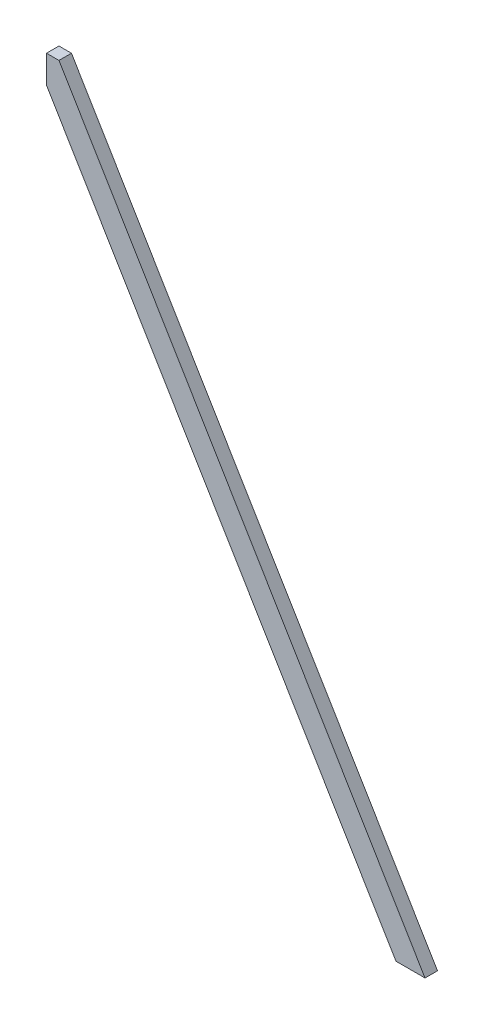
ISO-10303-21;
HEADER;
FILE_DESCRIPTION(('STEP AP214'),'2;1');
FILE_NAME('part.step','',(''),(''),'','','');
FILE_SCHEMA(('AUTOMOTIVE_DESIGN { 1 0 10303 214 1 1 1 1 }'));
ENDSEC;
DATA;
#1=APPLICATION_CONTEXT('core data for automotive mechanical design processes');
#2=APPLICATION_PROTOCOL_DEFINITION('international standard','automotive_design',2000,#1);
#3=PRODUCT_CONTEXT('',#1,'mechanical');
#4=PRODUCT('Part','Part','',(#3));
#5=PRODUCT_RELATED_PRODUCT_CATEGORY('part','',(#4));
#6=PRODUCT_DEFINITION_FORMATION('','',#4);
#7=PRODUCT_DEFINITION_CONTEXT('part definition',#1,'design');
#8=PRODUCT_DEFINITION('design','',#6,#7);
#9=PRODUCT_DEFINITION_SHAPE('','',#8);
#10=(LENGTH_UNIT() NAMED_UNIT(*) SI_UNIT(.MILLI.,.METRE.));
#11=(NAMED_UNIT(*) PLANE_ANGLE_UNIT() SI_UNIT($,.RADIAN.));
#12=(NAMED_UNIT(*) SI_UNIT($,.STERADIAN.) SOLID_ANGLE_UNIT());
#13=UNCERTAINTY_MEASURE_WITH_UNIT(LENGTH_MEASURE(1.E-05),#10,'distance_accuracy_value','');
#14=(GEOMETRIC_REPRESENTATION_CONTEXT(3) GLOBAL_UNCERTAINTY_ASSIGNED_CONTEXT((#13)) GLOBAL_UNIT_ASSIGNED_CONTEXT((#10,
#11,#12)) REPRESENTATION_CONTEXT('',''));
#15=CARTESIAN_POINT('',(0.,0.,0.));
#16=DIRECTION('',(0.,0.,1.));
#17=DIRECTION('',(1.,0.,0.));
#18=AXIS2_PLACEMENT_3D('',#15,#16,#17);
#19=CARTESIAN_POINT('',(-18.796,965.516993591491,-19.05));
#20=DIRECTION('',(-1.,0.,0.));
#21=DIRECTION('',(0.,0.,1.));
#22=AXIS2_PLACEMENT_3D('',#19,#20,#21);
#23=PLANE('',#22);
#24=DIRECTION('',(0.,0.,1.));
#25=VECTOR('',#24,1.);
#26=CARTESIAN_POINT('',(-18.796,933.686763033529,-19.05));
#27=LINE('',#26,#25);
#28=CARTESIAN_POINT('',(-18.796,933.686763033529,-19.05));
#29=VERTEX_POINT('',#28);
#30=CARTESIAN_POINT('',(-18.796,933.686763033529,0.));
#31=VERTEX_POINT('',#30);
#32=EDGE_CURVE('E58',#29,#31,#27,.T.);
#33=ORIENTED_EDGE('',*,*,#32,.F.);
#34=DIRECTION('',(0.,-1.,0.));
#35=VECTOR('',#34,1.);
#36=CARTESIAN_POINT('',(-18.796,965.516993591491,-19.05));
#37=LINE('',#36,#35);
#38=CARTESIAN_POINT('',(-18.796,891.326264322317,-19.05));
#39=VERTEX_POINT('',#38);
#40=EDGE_CURVE('E86',#29,#39,#37,.T.);
#41=ORIENTED_EDGE('',*,*,#40,.T.);
#42=DIRECTION('',(0.,0.,1.));
#43=VECTOR('',#42,1.);
#44=CARTESIAN_POINT('',(-18.796,891.326264322317,-19.05));
#45=LINE('',#44,#43);
#46=CARTESIAN_POINT('',(-18.796,891.326264322317,0.));
#47=VERTEX_POINT('',#46);
#48=EDGE_CURVE('E44',#39,#47,#45,.T.);
#49=ORIENTED_EDGE('',*,*,#48,.T.);
#50=DIRECTION('',(0.,-1.,0.));
#51=VECTOR('',#50,1.);
#52=CARTESIAN_POINT('',(-18.796,965.516993591491,0.));
#53=LINE('',#52,#51);
#54=EDGE_CURVE('E105',#31,#47,#53,.T.);
#55=ORIENTED_EDGE('',*,*,#54,.F.);
#56=EDGE_LOOP('',(#33,#41,#49,#55));
#57=FACE_BOUND('',#56,.T.);
#58=ADVANCED_FACE('F41',(#57),#23,.T.);
#59=CARTESIAN_POINT('',(559.054,0.,-19.05));
#60=DIRECTION('',(0.858064905723648,0.513541252058165,0.));
#61=DIRECTION('',(-0.513541252058165,0.858064905723648,0.));
#62=AXIS2_PLACEMENT_3D('',#59,#60,#61);
#63=PLANE('',#62);
#64=DIRECTION('',(0.,0.,1.));
#65=VECTOR('',#64,1.);
#66=CARTESIAN_POINT('',(0.254000000000001,933.686763033529,-19.05));
#67=LINE('',#66,#65);
#68=CARTESIAN_POINT('',(0.254000000000001,933.686763033529,-19.05));
#69=VERTEX_POINT('',#68);
#70=CARTESIAN_POINT('',(0.254000000000001,933.686763033529,0.));
#71=VERTEX_POINT('',#70);
#72=EDGE_CURVE('E98',#69,#71,#67,.T.);
#73=ORIENTED_EDGE('',*,*,#72,.T.);
#74=DIRECTION('',(-0.513541252058165,0.858064905723647,0.));
#75=VECTOR('',#74,1.);
#76=CARTESIAN_POINT('',(559.054,0.,0.));
#77=LINE('',#76,#75);
#78=CARTESIAN_POINT('',(559.054,0.,0.));
#79=VERTEX_POINT('',#78);
#80=EDGE_CURVE('E114',#79,#71,#77,.T.);
#81=ORIENTED_EDGE('',*,*,#80,.F.);
#82=DIRECTION('',(0.,0.,1.));
#83=VECTOR('',#82,1.);
#84=CARTESIAN_POINT('',(559.054,0.,-19.05));
#85=LINE('',#84,#83);
#86=CARTESIAN_POINT('',(559.054,0.,-19.05));
#87=VERTEX_POINT('',#86);
#88=EDGE_CURVE('E11',#87,#79,#85,.T.);
#89=ORIENTED_EDGE('',*,*,#88,.F.);
#90=DIRECTION('',(-0.513541252058165,0.858064905723647,0.));
#91=VECTOR('',#90,1.);
#92=CARTESIAN_POINT('',(559.054,0.,-19.05));
#93=LINE('',#92,#91);
#94=EDGE_CURVE('E127',#87,#69,#93,.T.);
#95=ORIENTED_EDGE('',*,*,#94,.T.);
#96=EDGE_LOOP('',(#73,#81,#89,#95));
#97=FACE_BOUND('',#96,.T.);
#98=ADVANCED_FACE('F147',(#97),#63,.T.);
#99=CARTESIAN_POINT('',(514.651764521241,0.,-19.05));
#100=DIRECTION('',(0.,-1.,0.));
#101=DIRECTION('',(0.,0.,-1.));
#102=AXIS2_PLACEMENT_3D('',#99,#100,#101);
#103=PLANE('',#102);
#104=DIRECTION('',(1.,0.,0.));
#105=VECTOR('',#104,1.);
#106=CARTESIAN_POINT('',(514.651764521241,0.,0.));
#107=LINE('',#106,#105);
#108=CARTESIAN_POINT('',(514.651764521241,0.,0.));
#109=VERTEX_POINT('',#108);
#110=EDGE_CURVE('E121',#109,#79,#107,.T.);
#111=ORIENTED_EDGE('',*,*,#110,.F.);
#112=DIRECTION('',(0.,0.,1.));
#113=VECTOR('',#112,1.);
#114=CARTESIAN_POINT('',(514.651764521241,0.,-19.05));
#115=LINE('',#114,#113);
#116=CARTESIAN_POINT('',(514.651764521241,0.,-19.05));
#117=VERTEX_POINT('',#116);
#118=EDGE_CURVE('E50',#117,#109,#115,.T.);
#119=ORIENTED_EDGE('',*,*,#118,.F.);
#120=DIRECTION('',(1.,0.,0.));
#121=VECTOR('',#120,1.);
#122=CARTESIAN_POINT('',(514.651764521241,0.,-19.05));
#123=LINE('',#122,#121);
#124=EDGE_CURVE('E118',#117,#87,#123,.T.);
#125=ORIENTED_EDGE('',*,*,#124,.T.);
#126=ORIENTED_EDGE('',*,*,#88,.T.);
#127=EDGE_LOOP('',(#111,#119,#125,#126));
#128=FACE_BOUND('',#127,.T.);
#129=ADVANCED_FACE('F148',(#128),#103,.T.);
#130=CARTESIAN_POINT('',(-18.796,891.326264322317,-19.05));
#131=DIRECTION('',(-0.858064905723647,-0.513541252058165,0.));
#132=DIRECTION('',(0.513541252058165,-0.858064905723647,0.));
#133=AXIS2_PLACEMENT_3D('',#130,#131,#132);
#134=PLANE('',#133);
#135=DIRECTION('',(0.513541252058165,-0.858064905723648,0.));
#136=VECTOR('',#135,1.);
#137=CARTESIAN_POINT('',(-18.796,891.326264322317,0.));
#138=LINE('',#137,#136);
#139=EDGE_CURVE('E132',#47,#109,#138,.T.);
#140=ORIENTED_EDGE('',*,*,#139,.F.);
#141=ORIENTED_EDGE('',*,*,#48,.F.);
#142=DIRECTION('',(0.513541252058165,-0.858064905723648,0.));
#143=VECTOR('',#142,1.);
#144=CARTESIAN_POINT('',(-18.796,891.326264322317,-19.05));
#145=LINE('',#144,#143);
#146=EDGE_CURVE('E112',#39,#117,#145,.T.);
#147=ORIENTED_EDGE('',*,*,#146,.T.);
#148=ORIENTED_EDGE('',*,*,#118,.T.);
#149=EDGE_LOOP('',(#140,#141,#147,#148));
#150=FACE_BOUND('',#149,.T.);
#151=ADVANCED_FACE('F141',(#150),#134,.T.);
#152=CARTESIAN_POINT('',(0.,0.,-19.05));
#153=DIRECTION('',(0.,0.,1.));
#154=DIRECTION('',(1.,0.,0.));
#155=AXIS2_PLACEMENT_3D('',#152,#153,#154);
#156=PLANE('',#155);
#157=ORIENTED_EDGE('',*,*,#40,.F.);
#158=DIRECTION('',(1.,0.,0.));
#159=VECTOR('',#158,1.);
#160=CARTESIAN_POINT('',(-18.796,933.686763033529,-19.05));
#161=LINE('',#160,#159);
#162=EDGE_CURVE('E95',#29,#69,#161,.T.);
#163=ORIENTED_EDGE('',*,*,#162,.T.);
#164=ORIENTED_EDGE('',*,*,#94,.F.);
#165=ORIENTED_EDGE('',*,*,#124,.F.);
#166=ORIENTED_EDGE('',*,*,#146,.F.);
#167=EDGE_LOOP('',(#157,#163,#164,#165,#166));
#168=FACE_BOUND('',#167,.T.);
#169=ADVANCED_FACE('F109',(#168),#156,.F.);
#170=CARTESIAN_POINT('',(0.,0.,0.));
#171=DIRECTION('',(0.,0.,1.));
#172=DIRECTION('',(1.,0.,0.));
#173=AXIS2_PLACEMENT_3D('',#170,#171,#172);
#174=PLANE('',#173);
#175=DIRECTION('',(1.,0.,0.));
#176=VECTOR('',#175,1.);
#177=CARTESIAN_POINT('',(-18.796,933.686763033529,0.));
#178=LINE('',#177,#176);
#179=EDGE_CURVE('E102',#31,#71,#178,.T.);
#180=ORIENTED_EDGE('',*,*,#179,.F.);
#181=ORIENTED_EDGE('',*,*,#54,.T.);
#182=ORIENTED_EDGE('',*,*,#139,.T.);
#183=ORIENTED_EDGE('',*,*,#110,.T.);
#184=ORIENTED_EDGE('',*,*,#80,.T.);
#185=EDGE_LOOP('',(#180,#181,#182,#183,#184));
#186=FACE_BOUND('',#185,.T.);
#187=ADVANCED_FACE('F143',(#186),#174,.T.);
#188=CARTESIAN_POINT('',(-18.796,933.686763033529,-19.05));
#189=DIRECTION('',(0.,-1.,0.));
#190=DIRECTION('',(0.,0.,-1.));
#191=AXIS2_PLACEMENT_3D('',#188,#189,#190);
#192=PLANE('',#191);
#193=ORIENTED_EDGE('',*,*,#179,.T.);
#194=ORIENTED_EDGE('',*,*,#72,.F.);
#195=ORIENTED_EDGE('',*,*,#162,.F.);
#196=ORIENTED_EDGE('',*,*,#32,.T.);
#197=EDGE_LOOP('',(#193,#194,#195,#196));
#198=FACE_BOUND('',#197,.T.);
#199=ADVANCED_FACE('F96',(#198),#192,.F.);
#200=CLOSED_SHELL('',(#58,#98,#129,#151,#169,#187,#199));
#201=MANIFOLD_SOLID_BREP('B2',#200);
#202=ADVANCED_BREP_SHAPE_REPRESENTATION('',(#18,#201),#14);
#203=SHAPE_DEFINITION_REPRESENTATION(#9,#202);
ENDSEC;
END-ISO-10303-21;
